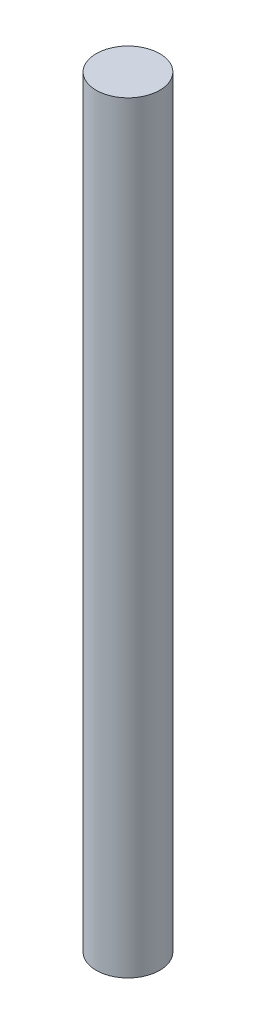
ISO-10303-21;
HEADER;
FILE_DESCRIPTION(('STEP AP214'),'2;1');
FILE_NAME('part.step','',(''),(''),'','','');
FILE_SCHEMA(('AUTOMOTIVE_DESIGN { 1 0 10303 214 1 1 1 1 }'));
ENDSEC;
DATA;
#1=APPLICATION_CONTEXT('core data for automotive mechanical design processes');
#2=APPLICATION_PROTOCOL_DEFINITION('international standard','automotive_design',2000,#1);
#3=PRODUCT_CONTEXT('',#1,'mechanical');
#4=PRODUCT('Part','Part','',(#3));
#5=PRODUCT_RELATED_PRODUCT_CATEGORY('part','',(#4));
#6=PRODUCT_DEFINITION_FORMATION('','',#4);
#7=PRODUCT_DEFINITION_CONTEXT('part definition',#1,'design');
#8=PRODUCT_DEFINITION('design','',#6,#7);
#9=PRODUCT_DEFINITION_SHAPE('','',#8);
#10=(LENGTH_UNIT() NAMED_UNIT(*) SI_UNIT(.MILLI.,.METRE.));
#11=(NAMED_UNIT(*) PLANE_ANGLE_UNIT() SI_UNIT($,.RADIAN.));
#12=(NAMED_UNIT(*) SI_UNIT($,.STERADIAN.) SOLID_ANGLE_UNIT());
#13=UNCERTAINTY_MEASURE_WITH_UNIT(LENGTH_MEASURE(1.E-05),#10,'distance_accuracy_value','');
#14=(GEOMETRIC_REPRESENTATION_CONTEXT(3) GLOBAL_UNCERTAINTY_ASSIGNED_CONTEXT((#13)) GLOBAL_UNIT_ASSIGNED_CONTEXT((#10,
#11,#12)) REPRESENTATION_CONTEXT('',''));
#15=CARTESIAN_POINT('',(0.,0.,0.));
#16=DIRECTION('',(0.,0.,1.));
#17=DIRECTION('',(1.,0.,0.));
#18=AXIS2_PLACEMENT_3D('',#15,#16,#17);
#19=CARTESIAN_POINT('',(0.,720.,0.));
#20=DIRECTION('',(0.,-1.,0.));
#21=DIRECTION('',(0.,0.,-1.));
#22=AXIS2_PLACEMENT_3D('',#19,#20,#21);
#23=CYLINDRICAL_SURFACE('',#22,30.);
#24=CARTESIAN_POINT('',(0.,720.,0.));
#25=DIRECTION('',(0.,1.,0.));
#26=DIRECTION('',(0.,0.,1.));
#27=AXIS2_PLACEMENT_3D('',#24,#25,#26);
#28=CIRCLE('',#27,30.);
#29=CARTESIAN_POINT('',(0.,720.,30.));
#30=VERTEX_POINT('',#29);
#31=EDGE_CURVE('E10',#30,#30,#28,.T.);
#32=ORIENTED_EDGE('',*,*,#31,.F.);
#33=EDGE_LOOP('',(#32));
#34=FACE_BOUND('',#33,.T.);
#35=CARTESIAN_POINT('',(0.,0.,0.));
#36=DIRECTION('',(0.,1.,0.));
#37=DIRECTION('',(0.,0.,1.));
#38=AXIS2_PLACEMENT_3D('',#35,#36,#37);
#39=CIRCLE('',#38,30.);
#40=CARTESIAN_POINT('',(0.,0.,30.));
#41=VERTEX_POINT('',#40);
#42=EDGE_CURVE('E40',#41,#41,#39,.T.);
#43=ORIENTED_EDGE('',*,*,#42,.T.);
#44=EDGE_LOOP('',(#43));
#45=FACE_BOUND('',#44,.T.);
#46=ADVANCED_FACE('F37',(#34,#45),#23,.T.);
#47=CARTESIAN_POINT('',(0.,720.,0.));
#48=DIRECTION('',(0.,1.,0.));
#49=DIRECTION('',(0.,0.,1.));
#50=AXIS2_PLACEMENT_3D('',#47,#48,#49);
#51=PLANE('',#50);
#52=ORIENTED_EDGE('',*,*,#31,.T.);
#53=EDGE_LOOP('',(#52));
#54=FACE_BOUND('',#53,.T.);
#55=ADVANCED_FACE('F54',(#54),#51,.T.);
#56=CARTESIAN_POINT('',(0.,0.,0.));
#57=DIRECTION('',(0.,1.,0.));
#58=DIRECTION('',(0.,0.,1.));
#59=AXIS2_PLACEMENT_3D('',#56,#57,#58);
#60=PLANE('',#59);
#61=ORIENTED_EDGE('',*,*,#42,.F.);
#62=EDGE_LOOP('',(#61));
#63=FACE_BOUND('',#62,.T.);
#64=ADVANCED_FACE('F52',(#63),#60,.F.);
#65=CLOSED_SHELL('',(#46,#55,#64));
#66=MANIFOLD_SOLID_BREP('B2',#65);
#67=ADVANCED_BREP_SHAPE_REPRESENTATION('',(#18,#66),#14);
#68=SHAPE_DEFINITION_REPRESENTATION(#9,#67);
ENDSEC;
END-ISO-10303-21;
